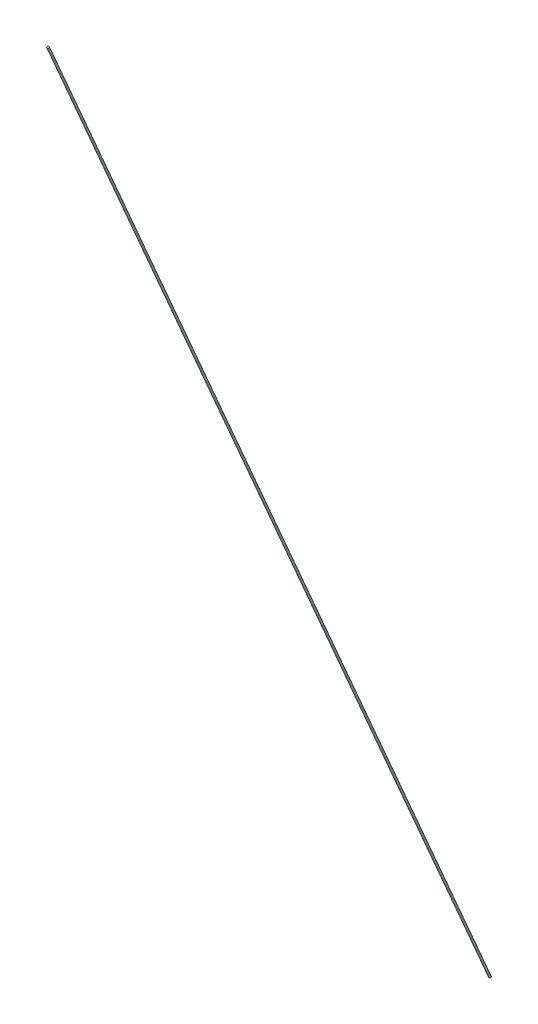
ISO-10303-21;
HEADER;
FILE_DESCRIPTION(('STEP AP214'),'2;1');
FILE_NAME('part.step','',(''),(''),'','','');
FILE_SCHEMA(('AUTOMOTIVE_DESIGN { 1 0 10303 214 1 1 1 1 }'));
ENDSEC;
DATA;
#1=APPLICATION_CONTEXT('core data for automotive mechanical design processes');
#2=APPLICATION_PROTOCOL_DEFINITION('international standard','automotive_design',2000,#1);
#3=PRODUCT_CONTEXT('',#1,'mechanical');
#4=PRODUCT('Part','Part','',(#3));
#5=PRODUCT_RELATED_PRODUCT_CATEGORY('part','',(#4));
#6=PRODUCT_DEFINITION_FORMATION('','',#4);
#7=PRODUCT_DEFINITION_CONTEXT('part definition',#1,'design');
#8=PRODUCT_DEFINITION('design','',#6,#7);
#9=PRODUCT_DEFINITION_SHAPE('','',#8);
#10=(LENGTH_UNIT() NAMED_UNIT(*) SI_UNIT(.MILLI.,.METRE.));
#11=(NAMED_UNIT(*) PLANE_ANGLE_UNIT() SI_UNIT($,.RADIAN.));
#12=(NAMED_UNIT(*) SI_UNIT($,.STERADIAN.) SOLID_ANGLE_UNIT());
#13=UNCERTAINTY_MEASURE_WITH_UNIT(LENGTH_MEASURE(1.E-05),#10,'distance_accuracy_value','');
#14=(GEOMETRIC_REPRESENTATION_CONTEXT(3) GLOBAL_UNCERTAINTY_ASSIGNED_CONTEXT((#13)) GLOBAL_UNIT_ASSIGNED_CONTEXT((#10,
#11,#12)) REPRESENTATION_CONTEXT('',''));
#15=CARTESIAN_POINT('',(0.,0.,0.));
#16=DIRECTION('',(0.,0.,1.));
#17=DIRECTION('',(1.,0.,0.));
#18=AXIS2_PLACEMENT_3D('',#15,#16,#17);
#19=CARTESIAN_POINT('',(0.,0.,0.));
#20=DIRECTION('',(0.,0.918438029815543,0.395564894029466));
#21=DIRECTION('',(0.,-0.395564894029466,0.918438029815543));
#22=AXIS2_PLACEMENT_3D('',#19,#20,#21);
#23=PLANE('',#22);
#24=CARTESIAN_POINT('',(0.,0.,0.));
#25=DIRECTION('',(0.,0.918438029815543,0.395564894029466));
#26=DIRECTION('',(0.,-0.395564894029466,0.918438029815543));
#27=AXIS2_PLACEMENT_3D('',#24,#25,#26);
#28=CIRCLE('',#27,0.5);
#29=CARTESIAN_POINT('',(0.,-0.197782447014733,0.459219014907772));
#30=VERTEX_POINT('',#29);
#31=EDGE_CURVE('E47',#30,#30,#28,.T.);
#32=ORIENTED_EDGE('',*,*,#31,.F.);
#33=EDGE_LOOP('',(#32));
#34=FACE_BOUND('',#33,.T.);
#35=ADVANCED_FACE('F41',(#34),#23,.F.);
#36=CARTESIAN_POINT('',(0.,505.,217.5));
#37=DIRECTION('',(0.,0.918438029815543,0.395564894029466));
#38=DIRECTION('',(0.,-0.395564894029466,0.918438029815543));
#39=AXIS2_PLACEMENT_3D('',#36,#37,#38);
#40=PLANE('',#39);
#41=CARTESIAN_POINT('',(0.,505.,217.5));
#42=DIRECTION('',(0.,0.918438029815543,0.395564894029466));
#43=DIRECTION('',(0.,-0.395564894029466,0.918438029815543));
#44=AXIS2_PLACEMENT_3D('',#41,#42,#43);
#45=CIRCLE('',#44,0.5);
#46=CARTESIAN_POINT('',(0.,504.802217552985,217.959219014908));
#47=VERTEX_POINT('',#46);
#48=EDGE_CURVE('E11',#47,#47,#45,.T.);
#49=ORIENTED_EDGE('',*,*,#48,.T.);
#50=EDGE_LOOP('',(#49));
#51=FACE_BOUND('',#50,.T.);
#52=ADVANCED_FACE('F56',(#51),#40,.T.);
#53=CARTESIAN_POINT('',(0.,0.,0.));
#54=DIRECTION('',(0.,0.918438029815543,0.395564894029467));
#55=DIRECTION('',(0.,-0.395564894029467,0.918438029815543));
#56=AXIS2_PLACEMENT_3D('',#53,#54,#55);
#57=CYLINDRICAL_SURFACE('',#56,0.5);
#58=ORIENTED_EDGE('',*,*,#48,.F.);
#59=EDGE_LOOP('',(#58));
#60=FACE_BOUND('',#59,.T.);
#61=ORIENTED_EDGE('',*,*,#31,.T.);
#62=EDGE_LOOP('',(#61));
#63=FACE_BOUND('',#62,.T.);
#64=ADVANCED_FACE('F53',(#60,#63),#57,.T.);
#65=CLOSED_SHELL('',(#35,#52,#64));
#66=MANIFOLD_SOLID_BREP('B2',#65);
#67=ADVANCED_BREP_SHAPE_REPRESENTATION('',(#18,#66),#14);
#68=SHAPE_DEFINITION_REPRESENTATION(#9,#67);
ENDSEC;
END-ISO-10303-21;
